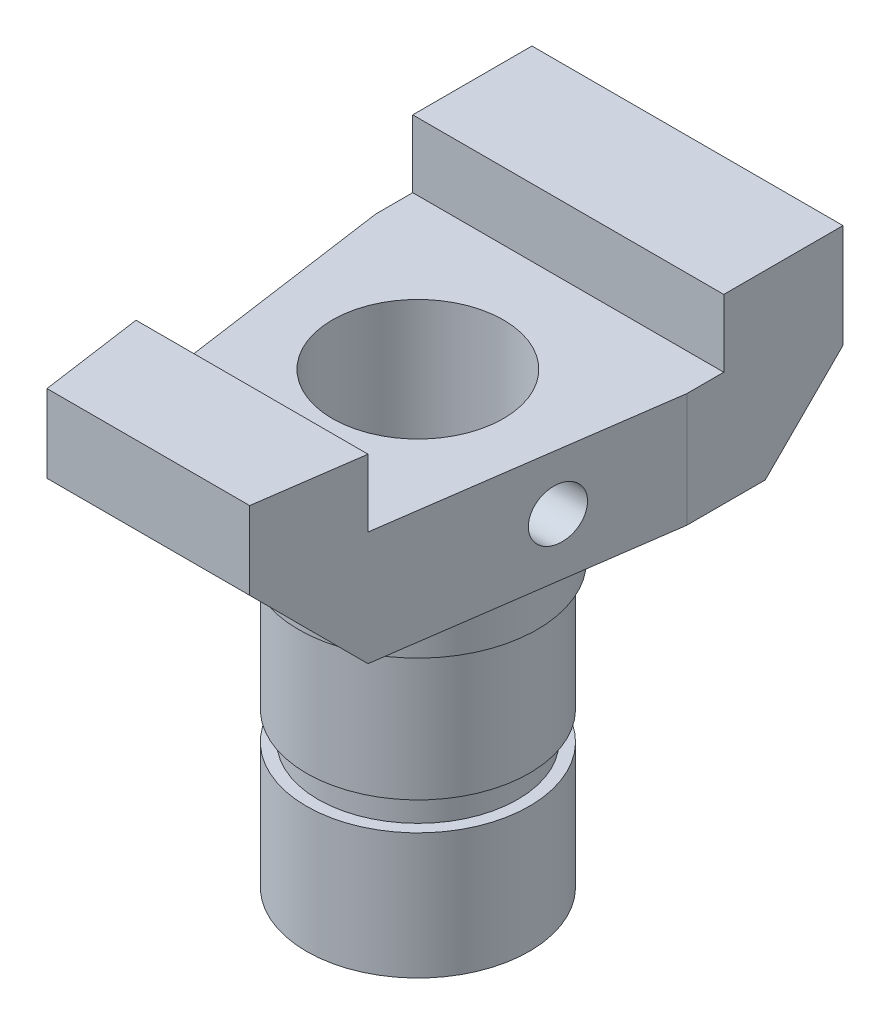
ISO-10303-21;
HEADER;
FILE_DESCRIPTION(('STEP AP214'),'2;1');
FILE_NAME('part.step','',(''),(''),'','','');
FILE_SCHEMA(('AUTOMOTIVE_DESIGN { 1 0 10303 214 1 1 1 1 }'));
ENDSEC;
DATA;
#1=APPLICATION_CONTEXT('core data for automotive mechanical design processes');
#2=APPLICATION_PROTOCOL_DEFINITION('international standard','automotive_design',2000,#1);
#3=PRODUCT_CONTEXT('',#1,'mechanical');
#4=PRODUCT('Part','Part','',(#3));
#5=PRODUCT_RELATED_PRODUCT_CATEGORY('part','',(#4));
#6=PRODUCT_DEFINITION_FORMATION('','',#4);
#7=PRODUCT_DEFINITION_CONTEXT('part definition',#1,'design');
#8=PRODUCT_DEFINITION('design','',#6,#7);
#9=PRODUCT_DEFINITION_SHAPE('','',#8);
#10=(LENGTH_UNIT() NAMED_UNIT(*) SI_UNIT(.MILLI.,.METRE.));
#11=(NAMED_UNIT(*) PLANE_ANGLE_UNIT() SI_UNIT($,.RADIAN.));
#12=(NAMED_UNIT(*) SI_UNIT($,.STERADIAN.) SOLID_ANGLE_UNIT());
#13=UNCERTAINTY_MEASURE_WITH_UNIT(LENGTH_MEASURE(1.E-05),#10,'distance_accuracy_value','');
#14=(GEOMETRIC_REPRESENTATION_CONTEXT(3) GLOBAL_UNCERTAINTY_ASSIGNED_CONTEXT((#13)) GLOBAL_UNIT_ASSIGNED_CONTEXT((#10,
#11,#12)) REPRESENTATION_CONTEXT('',''));
#15=CARTESIAN_POINT('',(0.,0.,0.));
#16=DIRECTION('',(0.,0.,1.));
#17=DIRECTION('',(1.,0.,0.));
#18=AXIS2_PLACEMENT_3D('',#15,#16,#17);
#19=CARTESIAN_POINT('',(30.,-3.,52.));
#20=DIRECTION('',(0.,1.,0.));
#21=DIRECTION('',(0.,0.,1.));
#22=AXIS2_PLACEMENT_3D('',#19,#20,#21);
#23=CONICAL_SURFACE('',#22,23.,0.785398163397449);
#24=CARTESIAN_POINT('',(30.,0.,52.));
#25=DIRECTION('',(0.,-1.,0.));
#26=DIRECTION('',(0.,0.,-1.));
#27=AXIS2_PLACEMENT_3D('',#24,#25,#26);
#28=CIRCLE('',#27,26.);
#29=CARTESIAN_POINT('',(30.,0.,26.));
#30=VERTEX_POINT('',#29);
#31=EDGE_CURVE('E62',#30,#30,#28,.T.);
#32=ORIENTED_EDGE('',*,*,#31,.T.);
#33=EDGE_LOOP('',(#32));
#34=FACE_BOUND('',#33,.T.);
#35=CARTESIAN_POINT('',(30.,-3.,52.));
#36=DIRECTION('',(0.,-1.,0.));
#37=DIRECTION('',(0.,0.,-1.));
#38=AXIS2_PLACEMENT_3D('',#35,#36,#37);
#39=CIRCLE('',#38,23.);
#40=CARTESIAN_POINT('',(30.,-3.,29.));
#41=VERTEX_POINT('',#40);
#42=EDGE_CURVE('E12',#41,#41,#39,.T.);
#43=ORIENTED_EDGE('',*,*,#42,.F.);
#44=EDGE_LOOP('',(#43));
#45=FACE_BOUND('',#44,.T.);
#46=ADVANCED_FACE('F52',(#34,#45),#23,.T.);
#47=CARTESIAN_POINT('',(30.,-10.,52.));
#48=DIRECTION('',(0.,-1.,0.));
#49=DIRECTION('',(0.,0.,-1.));
#50=AXIS2_PLACEMENT_3D('',#47,#48,#49);
#51=CYLINDRICAL_SURFACE('',#50,23.);
#52=ORIENTED_EDGE('',*,*,#42,.T.);
#53=EDGE_LOOP('',(#52));
#54=FACE_BOUND('',#53,.T.);
#55=CARTESIAN_POINT('',(30.,0.,52.));
#56=DIRECTION('',(0.,-1.,0.));
#57=DIRECTION('',(0.,0.,-1.));
#58=AXIS2_PLACEMENT_3D('',#55,#56,#57);
#59=CIRCLE('',#58,23.);
#60=CARTESIAN_POINT('',(30.,0.,29.));
#61=VERTEX_POINT('',#60);
#62=EDGE_CURVE('E58',#61,#61,#59,.T.);
#63=ORIENTED_EDGE('',*,*,#62,.F.);
#64=EDGE_LOOP('',(#63));
#65=FACE_BOUND('',#64,.T.);
#66=ADVANCED_FACE('F73',(#54,#65),#51,.F.);
#67=CARTESIAN_POINT('',(53.,0.,52.));
#68=DIRECTION('',(0.,1.,0.));
#69=DIRECTION('',(0.,0.,1.));
#70=AXIS2_PLACEMENT_3D('',#67,#68,#69);
#71=PLANE('',#70);
#72=ORIENTED_EDGE('',*,*,#62,.T.);
#73=EDGE_LOOP('',(#72));
#74=FACE_BOUND('',#73,.T.);
#75=ORIENTED_EDGE('',*,*,#31,.F.);
#76=EDGE_LOOP('',(#75));
#77=FACE_BOUND('',#76,.T.);
#78=ADVANCED_FACE('F71',(#74,#77),#71,.T.);
#79=CLOSED_SHELL('',(#46,#66,#78));
#80=MANIFOLD_SOLID_BREP('B2',#79);
#81=CARTESIAN_POINT('',(30.,-34.7526530404697,52.));
#82=DIRECTION('',(0.,1.,0.));
#83=DIRECTION('',(0.,0.,1.));
#84=AXIS2_PLACEMENT_3D('',#81,#82,#83);
#85=PLANE('',#84);
#86=CARTESIAN_POINT('',(30.,-34.7526530404697,52.));
#87=DIRECTION('',(0.,1.,0.));
#88=DIRECTION('',(0.,0.,1.));
#89=AXIS2_PLACEMENT_3D('',#86,#87,#88);
#90=CIRCLE('',#89,21.5);
#91=CARTESIAN_POINT('',(30.,-34.7526530404697,73.5));
#92=VERTEX_POINT('',#91);
#93=EDGE_CURVE('E341',#92,#92,#90,.T.);
#94=ORIENTED_EDGE('',*,*,#93,.F.);
#95=EDGE_LOOP('',(#94));
#96=FACE_BOUND('',#95,.T.);
#97=CARTESIAN_POINT('',(30.,-34.7526530404697,52.));
#98=DIRECTION('',(0.,1.,0.));
#99=DIRECTION('',(0.,0.,1.));
#100=AXIS2_PLACEMENT_3D('',#97,#98,#99);
#101=CIRCLE('',#100,19.248069568678);
#102=CARTESIAN_POINT('',(30.,-34.7526530404697,71.248069568678));
#103=VERTEX_POINT('',#102);
#104=EDGE_CURVE('E344',#103,#103,#101,.F.);
#105=ORIENTED_EDGE('',*,*,#104,.F.);
#106=EDGE_LOOP('',(#105));
#107=FACE_BOUND('',#106,.T.);
#108=ADVANCED_FACE('F99',(#96,#107),#85,.F.);
#109=CARTESIAN_POINT('',(30.,-32.2616098393399,52.));
#110=DIRECTION('',(0.,-1.,0.));
#111=DIRECTION('',(0.,0.,-1.));
#112=AXIS2_PLACEMENT_3D('',#109,#110,#111);
#113=CYLINDRICAL_SURFACE('',#112,19.248069568678);
#114=ORIENTED_EDGE('',*,*,#104,.T.);
#115=EDGE_LOOP('',(#114));
#116=FACE_BOUND('',#115,.T.);
#117=CARTESIAN_POINT('',(30.,-40.2528379739233,52.));
#118=DIRECTION('',(0.,1.,0.));
#119=DIRECTION('',(0.,0.,1.));
#120=AXIS2_PLACEMENT_3D('',#117,#118,#119);
#121=CIRCLE('',#120,19.248069568678);
#122=CARTESIAN_POINT('',(30.,-40.2528379739233,71.248069568678));
#123=VERTEX_POINT('',#122);
#124=EDGE_CURVE('E103',#123,#123,#121,.F.);
#125=ORIENTED_EDGE('',*,*,#124,.F.);
#126=EDGE_LOOP('',(#125));
#127=FACE_BOUND('',#126,.T.);
#128=ADVANCED_FACE('F320',(#116,#127),#113,.T.);
#129=CARTESIAN_POINT('',(30.,-66.,52.));
#130=DIRECTION('',(0.,1.,0.));
#131=DIRECTION('',(0.,0.,1.));
#132=AXIS2_PLACEMENT_3D('',#129,#130,#131);
#133=CYLINDRICAL_SURFACE('',#132,21.5);
#134=CARTESIAN_POINT('',(30.,-10.,52.));
#135=DIRECTION('',(0.,1.,0.));
#136=DIRECTION('',(0.,0.,1.));
#137=AXIS2_PLACEMENT_3D('',#134,#135,#136);
#138=CIRCLE('',#137,21.5);
#139=CARTESIAN_POINT('',(30.,-10.,73.5));
#140=VERTEX_POINT('',#139);
#141=EDGE_CURVE('E354',#140,#140,#138,.F.);
#142=ORIENTED_EDGE('',*,*,#141,.T.);
#143=EDGE_LOOP('',(#142));
#144=FACE_BOUND('',#143,.T.);
#145=ORIENTED_EDGE('',*,*,#93,.T.);
#146=EDGE_LOOP('',(#145));
#147=FACE_BOUND('',#146,.T.);
#148=ADVANCED_FACE('F317',(#144,#147),#133,.T.);
#149=CARTESIAN_POINT('',(30.,-40.2528379739233,52.));
#150=DIRECTION('',(0.,1.,0.));
#151=DIRECTION('',(0.,0.,1.));
#152=AXIS2_PLACEMENT_3D('',#149,#150,#151);
#153=PLANE('',#152);
#154=CARTESIAN_POINT('',(30.,-40.2528379739233,52.));
#155=DIRECTION('',(0.,1.,0.));
#156=DIRECTION('',(0.,0.,1.));
#157=AXIS2_PLACEMENT_3D('',#154,#155,#156);
#158=CIRCLE('',#157,21.5);
#159=CARTESIAN_POINT('',(30.,-40.2528379739233,73.5));
#160=VERTEX_POINT('',#159);
#161=EDGE_CURVE('E351',#160,#160,#158,.F.);
#162=ORIENTED_EDGE('',*,*,#161,.F.);
#163=EDGE_LOOP('',(#162));
#164=FACE_BOUND('',#163,.T.);
#165=ORIENTED_EDGE('',*,*,#124,.T.);
#166=EDGE_LOOP('',(#165));
#167=FACE_BOUND('',#166,.T.);
#168=ADVANCED_FACE('F101',(#164,#167),#153,.T.);
#169=CARTESIAN_POINT('',(30.,-10.,52.));
#170=DIRECTION('',(0.,1.,0.));
#171=DIRECTION('',(0.,0.,1.));
#172=AXIS2_PLACEMENT_3D('',#169,#170,#171);
#173=PLANE('',#172);
#174=CARTESIAN_POINT('',(30.,-10.,52.));
#175=DIRECTION('',(0.,1.,0.));
#176=DIRECTION('',(0.,0.,1.));
#177=AXIS2_PLACEMENT_3D('',#174,#175,#176);
#178=CIRCLE('',#177,23.);
#179=CARTESIAN_POINT('',(30.,-10.,75.));
#180=VERTEX_POINT('',#179);
#181=EDGE_CURVE('E353',#180,#180,#178,.T.);
#182=ORIENTED_EDGE('',*,*,#181,.F.);
#183=EDGE_LOOP('',(#182));
#184=FACE_BOUND('',#183,.T.);
#185=ORIENTED_EDGE('',*,*,#141,.F.);
#186=EDGE_LOOP('',(#185));
#187=FACE_BOUND('',#186,.T.);
#188=ADVANCED_FACE('F312',(#184,#187),#173,.F.);
#189=CARTESIAN_POINT('',(30.,-37.9834483062288,52.));
#190=DIRECTION('',(0.,-1.,0.));
#191=DIRECTION('',(0.,0.,-1.));
#192=AXIS2_PLACEMENT_3D('',#189,#190,#191);
#193=CYLINDRICAL_SURFACE('',#192,21.5);
#194=CARTESIAN_POINT('',(30.,-64.5045488826458,52.));
#195=DIRECTION('',(0.,1.,0.));
#196=DIRECTION('',(0.,0.,1.));
#197=AXIS2_PLACEMENT_3D('',#194,#195,#196);
#198=CIRCLE('',#197,21.5);
#199=CARTESIAN_POINT('',(30.,-64.5045488826458,73.5));
#200=VERTEX_POINT('',#199);
#201=EDGE_CURVE('E413',#200,#200,#198,.T.);
#202=ORIENTED_EDGE('',*,*,#201,.T.);
#203=EDGE_LOOP('',(#202));
#204=FACE_BOUND('',#203,.T.);
#205=ORIENTED_EDGE('',*,*,#161,.T.);
#206=EDGE_LOOP('',(#205));
#207=FACE_BOUND('',#206,.T.);
#208=ADVANCED_FACE('F308',(#204,#207),#193,.T.);
#209=CARTESIAN_POINT('',(30.,-10.,52.));
#210=DIRECTION('',(0.,1.,0.));
#211=DIRECTION('',(0.,0.,1.));
#212=AXIS2_PLACEMENT_3D('',#209,#210,#211);
#213=CYLINDRICAL_SURFACE('',#212,23.);
#214=CARTESIAN_POINT('',(30.,0.,52.));
#215=DIRECTION('',(0.,1.,0.));
#216=DIRECTION('',(0.,0.,1.));
#217=AXIS2_PLACEMENT_3D('',#214,#215,#216);
#218=CIRCLE('',#217,23.);
#219=CARTESIAN_POINT('',(30.,0.,75.));
#220=VERTEX_POINT('',#219);
#221=EDGE_CURVE('E442',#220,#220,#218,.T.);
#222=ORIENTED_EDGE('',*,*,#221,.F.);
#223=EDGE_LOOP('',(#222));
#224=FACE_BOUND('',#223,.T.);
#225=ORIENTED_EDGE('',*,*,#181,.T.);
#226=EDGE_LOOP('',(#225));
#227=FACE_BOUND('',#226,.T.);
#228=ADVANCED_FACE('F304',(#224,#227),#213,.T.);
#229=CARTESIAN_POINT('',(0.,0.,15.));
#230=DIRECTION('',(0.,0.707106781186548,0.707106781186548));
#231=DIRECTION('',(0.,-0.707106781186548,0.707106781186548));
#232=AXIS2_PLACEMENT_3D('',#229,#230,#231);
#233=PLANE('',#232);
#234=DIRECTION('',(-1.,0.,0.));
#235=VECTOR('',#234,1.);
#236=CARTESIAN_POINT('',(30.,15.,0.));
#237=LINE('',#236,#235);
#238=CARTESIAN_POINT('',(60.,15.,0.));
#239=VERTEX_POINT('',#238);
#240=CARTESIAN_POINT('',(0.,15.,0.));
#241=VERTEX_POINT('',#240);
#242=EDGE_CURVE('E358',#239,#241,#237,.T.);
#243=ORIENTED_EDGE('',*,*,#242,.F.);
#244=DIRECTION('',(0.,0.707106781186547,-0.707106781186547));
#245=VECTOR('',#244,1.);
#246=CARTESIAN_POINT('',(60.,0.,15.));
#247=LINE('',#246,#245);
#248=CARTESIAN_POINT('',(60.,0.,15.));
#249=VERTEX_POINT('',#248);
#250=EDGE_CURVE('E421',#249,#239,#247,.T.);
#251=ORIENTED_EDGE('',*,*,#250,.F.);
#252=DIRECTION('',(1.,0.,0.));
#253=VECTOR('',#252,1.);
#254=CARTESIAN_POINT('',(0.,0.,15.));
#255=LINE('',#254,#253);
#256=CARTESIAN_POINT('',(0.,0.,15.));
#257=VERTEX_POINT('',#256);
#258=EDGE_CURVE('E437',#257,#249,#255,.T.);
#259=ORIENTED_EDGE('',*,*,#258,.F.);
#260=DIRECTION('',(0.,-0.707106781186547,0.707106781186547));
#261=VECTOR('',#260,1.);
#262=CARTESIAN_POINT('',(0.,15.,0.));
#263=LINE('',#262,#261);
#264=EDGE_CURVE('E443',#241,#257,#263,.T.);
#265=ORIENTED_EDGE('',*,*,#264,.F.);
#266=EDGE_LOOP('',(#243,#251,#259,#265));
#267=FACE_BOUND('',#266,.T.);
#268=ADVANCED_FACE('F300',(#267),#233,.F.);
#269=CARTESIAN_POINT('',(30.,35.,0.));
#270=DIRECTION('',(0.,0.,-1.));
#271=DIRECTION('',(-1.,0.,0.));
#272=AXIS2_PLACEMENT_3D('',#269,#270,#271);
#273=PLANE('',#272);
#274=DIRECTION('',(0.,1.,0.));
#275=VECTOR('',#274,1.);
#276=CARTESIAN_POINT('',(60.,35.,0.));
#277=LINE('',#276,#275);
#278=CARTESIAN_POINT('',(60.,35.,0.));
#279=VERTEX_POINT('',#278);
#280=EDGE_CURVE('E418',#239,#279,#277,.T.);
#281=ORIENTED_EDGE('',*,*,#280,.F.);
#282=ORIENTED_EDGE('',*,*,#242,.T.);
#283=DIRECTION('',(0.,1.,0.));
#284=VECTOR('',#283,1.);
#285=CARTESIAN_POINT('',(0.,35.,0.));
#286=LINE('',#285,#284);
#287=CARTESIAN_POINT('',(0.,35.,0.));
#288=VERTEX_POINT('',#287);
#289=EDGE_CURVE('E445',#288,#241,#286,.F.);
#290=ORIENTED_EDGE('',*,*,#289,.F.);
#291=DIRECTION('',(1.,0.,0.));
#292=VECTOR('',#291,1.);
#293=CARTESIAN_POINT('',(0.,35.,0.));
#294=LINE('',#293,#292);
#295=EDGE_CURVE('E369',#288,#279,#294,.T.);
#296=ORIENTED_EDGE('',*,*,#295,.T.);
#297=EDGE_LOOP('',(#281,#282,#290,#296));
#298=FACE_BOUND('',#297,.T.);
#299=ADVANCED_FACE('F296',(#298),#273,.T.);
#300=CARTESIAN_POINT('',(0.,0.,84.));
#301=DIRECTION('',(0.,0.707106781186548,-0.707106781186547));
#302=DIRECTION('',(0.,0.707106781186547,0.707106781186548));
#303=AXIS2_PLACEMENT_3D('',#300,#301,#302);
#304=PLANE('',#303);
#305=DIRECTION('',(1.,0.,0.));
#306=VECTOR('',#305,1.);
#307=CARTESIAN_POINT('',(8.63207958549231,20.,104.));
#308=LINE('',#307,#306);
#309=CARTESIAN_POINT('',(10.4523067731235,20.,104.));
#310=VERTEX_POINT('',#309);
#311=CARTESIAN_POINT('',(49.5476932268765,20.,104.));
#312=VERTEX_POINT('',#311);
#313=EDGE_CURVE('E416',#310,#312,#308,.T.);
#314=ORIENTED_EDGE('',*,*,#313,.F.);
#315=DIRECTION('',(0.0995651231268555,0.703593201451213,0.703593201451213));
#316=VECTOR('',#315,1.);
#317=CARTESIAN_POINT('',(7.54655707262303,-0.533954764322473,83.4660452356775));
#318=LINE('',#317,#316);
#319=CARTESIAN_POINT('',(7.62211674509327,0.,84.));
#320=VERTEX_POINT('',#319);
#321=EDGE_CURVE('E391',#320,#310,#318,.T.);
#322=ORIENTED_EDGE('',*,*,#321,.F.);
#323=DIRECTION('',(1.,0.,0.));
#324=VECTOR('',#323,1.);
#325=CARTESIAN_POINT('',(0.,0.,84.));
#326=LINE('',#325,#324);
#327=CARTESIAN_POINT('',(52.3778832549067,0.,84.));
#328=VERTEX_POINT('',#327);
#329=EDGE_CURVE('E434',#328,#320,#326,.F.);
#330=ORIENTED_EDGE('',*,*,#329,.F.);
#331=DIRECTION('',(0.0995651231268555,-0.703593201451213,-0.703593201451213));
#332=VECTOR('',#331,1.);
#333=CARTESIAN_POINT('',(51.858650102781,3.66924585970003,87.6692458597));
#334=LINE('',#333,#332);
#335=EDGE_CURVE('E397',#312,#328,#334,.T.);
#336=ORIENTED_EDGE('',*,*,#335,.F.);
#337=EDGE_LOOP('',(#314,#322,#330,#336));
#338=FACE_BOUND('',#337,.T.);
#339=ADVANCED_FACE('F292',(#338),#304,.F.);
#340=CARTESIAN_POINT('',(8.63207958549231,35.,104.));
#341=DIRECTION('',(0.,0.,1.));
#342=DIRECTION('',(1.,0.,0.));
#343=AXIS2_PLACEMENT_3D('',#340,#341,#342);
#344=PLANE('',#343);
#345=DIRECTION('',(0.,-1.,0.));
#346=VECTOR('',#345,1.);
#347=CARTESIAN_POINT('',(10.4523067731235,35.,104.));
#348=LINE('',#347,#346);
#349=CARTESIAN_POINT('',(10.4523067731235,35.,104.));
#350=VERTEX_POINT('',#349);
#351=EDGE_CURVE('E348',#350,#310,#348,.T.);
#352=ORIENTED_EDGE('',*,*,#351,.T.);
#353=ORIENTED_EDGE('',*,*,#313,.T.);
#354=DIRECTION('',(0.,1.,0.));
#355=VECTOR('',#354,1.);
#356=CARTESIAN_POINT('',(49.5476932268765,35.,104.));
#357=LINE('',#356,#355);
#358=CARTESIAN_POINT('',(49.5476932268765,35.,104.));
#359=VERTEX_POINT('',#358);
#360=EDGE_CURVE('E405',#312,#359,#357,.T.);
#361=ORIENTED_EDGE('',*,*,#360,.T.);
#362=DIRECTION('',(1.,0.,0.));
#363=VECTOR('',#362,1.);
#364=CARTESIAN_POINT('',(8.63207958549231,35.,104.));
#365=LINE('',#364,#363);
#366=EDGE_CURVE('E366',#350,#359,#365,.T.);
#367=ORIENTED_EDGE('',*,*,#366,.F.);
#368=EDGE_LOOP('',(#352,#353,#361,#367));
#369=FACE_BOUND('',#368,.T.);
#370=ADVANCED_FACE('F289',(#369),#344,.T.);
#371=CARTESIAN_POINT('',(30.,-64.5045488826458,52.));
#372=DIRECTION('',(0.,1.,0.));
#373=DIRECTION('',(0.,0.,1.));
#374=AXIS2_PLACEMENT_3D('',#371,#372,#373);
#375=PLANE('',#374);
#376=CARTESIAN_POINT('',(30.,-64.5045488826458,37.));
#377=DIRECTION('',(0.,-1.,0.));
#378=DIRECTION('',(0.,0.,-1.));
#379=AXIS2_PLACEMENT_3D('',#376,#377,#378);
#380=CIRCLE('',#379,2.09999999999999);
#381=CARTESIAN_POINT('',(30.,-64.5045488826458,34.9));
#382=VERTEX_POINT('',#381);
#383=EDGE_CURVE('E201',#382,#382,#380,.T.);
#384=ORIENTED_EDGE('',*,*,#383,.F.);
#385=EDGE_LOOP('',(#384));
#386=FACE_BOUND('',#385,.T.);
#387=CARTESIAN_POINT('',(30.,-64.5045488826458,67.));
#388=DIRECTION('',(0.,-1.,0.));
#389=DIRECTION('',(0.,0.,-1.));
#390=AXIS2_PLACEMENT_3D('',#387,#388,#389);
#391=CIRCLE('',#390,2.09999999999999);
#392=CARTESIAN_POINT('',(30.,-64.5045488826458,64.9));
#393=VERTEX_POINT('',#392);
#394=EDGE_CURVE('E200',#393,#393,#391,.T.);
#395=ORIENTED_EDGE('',*,*,#394,.F.);
#396=EDGE_LOOP('',(#395));
#397=FACE_BOUND('',#396,.T.);
#398=ORIENTED_EDGE('',*,*,#201,.F.);
#399=EDGE_LOOP('',(#398));
#400=FACE_BOUND('',#399,.T.);
#401=CARTESIAN_POINT('',(30.,-64.5045488826458,52.));
#402=DIRECTION('',(0.,1.,0.));
#403=DIRECTION('',(0.,0.,1.));
#404=AXIS2_PLACEMENT_3D('',#401,#402,#403);
#405=CIRCLE('',#404,11.5);
#406=CARTESIAN_POINT('',(30.,-64.5045488826458,63.5));
#407=VERTEX_POINT('',#406);
#408=EDGE_CURVE('E379',#407,#407,#405,.T.);
#409=ORIENTED_EDGE('',*,*,#408,.T.);
#410=EDGE_LOOP('',(#409));
#411=FACE_BOUND('',#410,.T.);
#412=ADVANCED_FACE('F287',(#386,#397,#400,#411),#375,.F.);
#413=CARTESIAN_POINT('',(0.,35.,0.));
#414=DIRECTION('',(0.,-1.,0.));
#415=DIRECTION('',(0.,0.,-1.));
#416=AXIS2_PLACEMENT_3D('',#413,#414,#415);
#417=PLANE('',#416);
#418=DIRECTION('',(0.,0.,1.));
#419=VECTOR('',#418,1.);
#420=CARTESIAN_POINT('',(0.,35.,0.));
#421=LINE('',#420,#419);
#422=CARTESIAN_POINT('',(0.,35.,23.));
#423=VERTEX_POINT('',#422);
#424=EDGE_CURVE('E415',#423,#288,#421,.F.);
#425=ORIENTED_EDGE('',*,*,#424,.F.);
#426=DIRECTION('',(1.,0.,0.));
#427=VECTOR('',#426,1.);
#428=CARTESIAN_POINT('',(60.,35.,23.));
#429=LINE('',#428,#427);
#430=CARTESIAN_POINT('',(60.,35.,23.));
#431=VERTEX_POINT('',#430);
#432=EDGE_CURVE('E376',#431,#423,#429,.F.);
#433=ORIENTED_EDGE('',*,*,#432,.F.);
#434=DIRECTION('',(0.,0.,-1.));
#435=VECTOR('',#434,1.);
#436=CARTESIAN_POINT('',(60.,35.,0.));
#437=LINE('',#436,#435);
#438=EDGE_CURVE('E432',#279,#431,#437,.F.);
#439=ORIENTED_EDGE('',*,*,#438,.F.);
#440=ORIENTED_EDGE('',*,*,#295,.F.);
#441=EDGE_LOOP('',(#425,#433,#439,#440));
#442=FACE_BOUND('',#441,.T.);
#443=ADVANCED_FACE('F283',(#442),#417,.F.);
#444=CARTESIAN_POINT('',(0.,35.,0.));
#445=DIRECTION('',(-1.,0.,0.));
#446=DIRECTION('',(0.,0.,1.));
#447=AXIS2_PLACEMENT_3D('',#444,#445,#446);
#448=PLANE('',#447);
#449=ORIENTED_EDGE('',*,*,#424,.T.);
#450=ORIENTED_EDGE('',*,*,#289,.T.);
#451=ORIENTED_EDGE('',*,*,#264,.T.);
#452=DIRECTION('',(0.,0.,-1.));
#453=VECTOR('',#452,1.);
#454=CARTESIAN_POINT('',(0.,0.,0.));
#455=LINE('',#454,#453);
#456=CARTESIAN_POINT('',(0.,0.,30.1370673375027));
#457=VERTEX_POINT('',#456);
#458=EDGE_CURVE('E439',#457,#257,#455,.T.);
#459=ORIENTED_EDGE('',*,*,#458,.F.);
#460=DIRECTION('',(0.,-1.,0.));
#461=VECTOR('',#460,1.);
#462=CARTESIAN_POINT('',(0.,35.,30.1370673375027));
#463=LINE('',#462,#461);
#464=CARTESIAN_POINT('',(0.,22.,30.1370673375027));
#465=VERTEX_POINT('',#464);
#466=EDGE_CURVE('E377',#465,#457,#463,.T.);
#467=ORIENTED_EDGE('',*,*,#466,.F.);
#468=DIRECTION('',(0.,0.,1.));
#469=VECTOR('',#468,1.);
#470=CARTESIAN_POINT('',(0.,22.,0.));
#471=LINE('',#470,#469);
#472=CARTESIAN_POINT('',(0.,22.,23.));
#473=VERTEX_POINT('',#472);
#474=EDGE_CURVE('E109',#473,#465,#471,.T.);
#475=ORIENTED_EDGE('',*,*,#474,.F.);
#476=DIRECTION('',(0.,1.,0.));
#477=VECTOR('',#476,1.);
#478=CARTESIAN_POINT('',(0.,23.,23.));
#479=LINE('',#478,#477);
#480=EDGE_CURVE('E486',#423,#473,#479,.F.);
#481=ORIENTED_EDGE('',*,*,#480,.F.);
#482=EDGE_LOOP('',(#449,#450,#451,#459,#467,#475,#481));
#483=FACE_BOUND('',#482,.T.);
#484=ADVANCED_FACE('F279',(#483),#448,.T.);
#485=CARTESIAN_POINT('',(0.,0.,0.));
#486=DIRECTION('',(0.,-1.,0.));
#487=DIRECTION('',(0.,0.,-1.));
#488=AXIS2_PLACEMENT_3D('',#485,#486,#487);
#489=PLANE('',#488);
#490=ORIENTED_EDGE('',*,*,#329,.T.);
#491=DIRECTION('',(0.140113572243511,0.,0.99013543865128));
#492=VECTOR('',#491,1.);
#493=CARTESIAN_POINT('',(7.64194414684103,0.,84.1401135722435));
#494=LINE('',#493,#492);
#495=EDGE_CURVE('E373',#457,#320,#494,.T.);
#496=ORIENTED_EDGE('',*,*,#495,.F.);
#497=ORIENTED_EDGE('',*,*,#458,.T.);
#498=ORIENTED_EDGE('',*,*,#258,.T.);
#499=DIRECTION('',(0.,0.,-1.));
#500=VECTOR('',#499,1.);
#501=CARTESIAN_POINT('',(60.,0.,0.));
#502=LINE('',#501,#500);
#503=CARTESIAN_POINT('',(60.,0.,30.1370673375028));
#504=VERTEX_POINT('',#503);
#505=EDGE_CURVE('E425',#504,#249,#502,.T.);
#506=ORIENTED_EDGE('',*,*,#505,.F.);
#507=DIRECTION('',(0.140113572243511,0.,-0.99013543865128));
#508=VECTOR('',#507,1.);
#509=CARTESIAN_POINT('',(52.358055853159,0.,84.1401135722435));
#510=LINE('',#509,#508);
#511=EDGE_CURVE('E399',#328,#504,#510,.T.);
#512=ORIENTED_EDGE('',*,*,#511,.F.);
#513=EDGE_LOOP('',(#490,#496,#497,#498,#506,#512));
#514=FACE_BOUND('',#513,.T.);
#515=ORIENTED_EDGE('',*,*,#221,.T.);
#516=EDGE_LOOP('',(#515));
#517=FACE_BOUND('',#516,.T.);
#518=ADVANCED_FACE('F275',(#514,#517),#489,.T.);
#519=CARTESIAN_POINT('',(60.,35.,0.));
#520=DIRECTION('',(1.,0.,0.));
#521=DIRECTION('',(0.,0.,-1.));
#522=AXIS2_PLACEMENT_3D('',#519,#520,#521);
#523=PLANE('',#522);
#524=ORIENTED_EDGE('',*,*,#280,.T.);
#525=ORIENTED_EDGE('',*,*,#438,.T.);
#526=DIRECTION('',(0.,1.,0.));
#527=VECTOR('',#526,1.);
#528=CARTESIAN_POINT('',(60.,23.,23.));
#529=LINE('',#528,#527);
#530=CARTESIAN_POINT('',(60.,22.,23.));
#531=VERTEX_POINT('',#530);
#532=EDGE_CURVE('E403',#531,#431,#529,.T.);
#533=ORIENTED_EDGE('',*,*,#532,.F.);
#534=DIRECTION('',(0.,0.,1.));
#535=VECTOR('',#534,1.);
#536=CARTESIAN_POINT('',(60.,22.,0.));
#537=LINE('',#536,#535);
#538=CARTESIAN_POINT('',(60.,22.,30.1370673375028));
#539=VERTEX_POINT('',#538);
#540=EDGE_CURVE('E50',#531,#539,#537,.T.);
#541=ORIENTED_EDGE('',*,*,#540,.T.);
#542=DIRECTION('',(0.,1.,0.));
#543=VECTOR('',#542,1.);
#544=CARTESIAN_POINT('',(60.,35.,30.1370673375028));
#545=LINE('',#544,#543);
#546=EDGE_CURVE('E402',#504,#539,#545,.T.);
#547=ORIENTED_EDGE('',*,*,#546,.F.);
#548=ORIENTED_EDGE('',*,*,#505,.T.);
#549=ORIENTED_EDGE('',*,*,#250,.T.);
#550=EDGE_LOOP('',(#524,#525,#533,#541,#547,#548,#549));
#551=FACE_BOUND('',#550,.T.);
#552=ADVANCED_FACE('F271',(#551),#523,.T.);
#553=CARTESIAN_POINT('',(0.,35.,0.));
#554=DIRECTION('',(0.,-1.,0.));
#555=DIRECTION('',(0.,0.,-1.));
#556=AXIS2_PLACEMENT_3D('',#553,#554,#555);
#557=PLANE('',#556);
#558=DIRECTION('',(-1.,0.,0.));
#559=VECTOR('',#558,1.);
#560=CARTESIAN_POINT('',(51.3679204145077,35.,84.));
#561=LINE('',#560,#559);
#562=CARTESIAN_POINT('',(7.62211674509326,35.,84.));
#563=VERTEX_POINT('',#562);
#564=CARTESIAN_POINT('',(52.3778832549067,35.,84.));
#565=VERTEX_POINT('',#564);
#566=EDGE_CURVE('E410',#563,#565,#561,.F.);
#567=ORIENTED_EDGE('',*,*,#566,.F.);
#568=DIRECTION('',(-0.140113572243511,0.,-0.99013543865128));
#569=VECTOR('',#568,1.);
#570=CARTESIAN_POINT('',(-4.18095794488078,35.,0.591645274160773));
#571=LINE('',#570,#569);
#572=EDGE_CURVE('E345',#350,#563,#571,.T.);
#573=ORIENTED_EDGE('',*,*,#572,.F.);
#574=ORIENTED_EDGE('',*,*,#366,.T.);
#575=DIRECTION('',(-0.140113572243511,0.,0.99013543865128));
#576=VECTOR('',#575,1.);
#577=CARTESIAN_POINT('',(63.0030491572705,35.,8.91553007302037));
#578=LINE('',#577,#576);
#579=EDGE_CURVE('E393',#565,#359,#578,.T.);
#580=ORIENTED_EDGE('',*,*,#579,.F.);
#581=EDGE_LOOP('',(#567,#573,#574,#580));
#582=FACE_BOUND('',#581,.T.);
#583=ADVANCED_FACE('F267',(#582),#557,.F.);
#584=CARTESIAN_POINT('',(30.,-44.2245488826458,52.));
#585=DIRECTION('',(0.,-1.,0.));
#586=DIRECTION('',(0.,0.,-1.));
#587=AXIS2_PLACEMENT_3D('',#584,#585,#586);
#588=CYLINDRICAL_SURFACE('',#587,11.5);
#589=ORIENTED_EDGE('',*,*,#408,.F.);
#590=EDGE_LOOP('',(#589));
#591=FACE_BOUND('',#590,.T.);
#592=CARTESIAN_POINT('',(30.,-44.2245488826458,52.));
#593=DIRECTION('',(0.,-1.,0.));
#594=DIRECTION('',(0.,0.,-1.));
#595=AXIS2_PLACEMENT_3D('',#592,#593,#594);
#596=CIRCLE('',#595,11.5);
#597=CARTESIAN_POINT('',(30.,-44.2245488826458,40.5));
#598=VERTEX_POINT('',#597);
#599=EDGE_CURVE('E384',#598,#598,#596,.T.);
#600=ORIENTED_EDGE('',*,*,#599,.F.);
#601=EDGE_LOOP('',(#600));
#602=FACE_BOUND('',#601,.T.);
#603=ADVANCED_FACE('F264',(#591,#602),#588,.F.);
#604=CARTESIAN_POINT('',(7.64194414684103,35.,84.1401135722435));
#605=DIRECTION('',(-0.99013543865128,0.,0.140113572243511));
#606=DIRECTION('',(0.140113572243511,0.,0.99013543865128));
#607=AXIS2_PLACEMENT_3D('',#604,#605,#606);
#608=PLANE('',#607);
#609=ORIENTED_EDGE('',*,*,#495,.T.);
#610=ORIENTED_EDGE('',*,*,#321,.T.);
#611=ORIENTED_EDGE('',*,*,#351,.F.);
#612=ORIENTED_EDGE('',*,*,#572,.T.);
#613=DIRECTION('',(0.,1.,0.));
#614=VECTOR('',#613,1.);
#615=CARTESIAN_POINT('',(7.62211674509326,23.,84.));
#616=LINE('',#615,#614);
#617=CARTESIAN_POINT('',(7.62211674509327,22.,84.));
#618=VERTEX_POINT('',#617);
#619=EDGE_CURVE('E385',#618,#563,#616,.T.);
#620=ORIENTED_EDGE('',*,*,#619,.F.);
#621=DIRECTION('',(-0.140113572243511,0.,-0.99013543865128));
#622=VECTOR('',#621,1.);
#623=CARTESIAN_POINT('',(-4.18095794488078,22.,0.591645274160773));
#624=LINE('',#623,#622);
#625=EDGE_CURVE('E380',#618,#465,#624,.T.);
#626=ORIENTED_EDGE('',*,*,#625,.T.);
#627=ORIENTED_EDGE('',*,*,#466,.T.);
#628=EDGE_LOOP('',(#609,#610,#611,#612,#620,#626,#627));
#629=FACE_BOUND('',#628,.T.);
#630=ADVANCED_FACE('F262',(#629),#608,.T.);
#631=CARTESIAN_POINT('',(60.,23.,23.));
#632=DIRECTION('',(0.,0.,1.));
#633=DIRECTION('',(1.,0.,0.));
#634=AXIS2_PLACEMENT_3D('',#631,#632,#633);
#635=PLANE('',#634);
#636=DIRECTION('',(1.,0.,0.));
#637=VECTOR('',#636,1.);
#638=CARTESIAN_POINT('',(0.,22.,23.));
#639=LINE('',#638,#637);
#640=EDGE_CURVE('E383',#473,#531,#639,.T.);
#641=ORIENTED_EDGE('',*,*,#640,.T.);
#642=ORIENTED_EDGE('',*,*,#532,.T.);
#643=ORIENTED_EDGE('',*,*,#432,.T.);
#644=ORIENTED_EDGE('',*,*,#480,.T.);
#645=EDGE_LOOP('',(#641,#642,#643,#644));
#646=FACE_BOUND('',#645,.T.);
#647=ADVANCED_FACE('F259',(#646),#635,.T.);
#648=CARTESIAN_POINT('',(52.358055853159,35.,84.1401135722435));
#649=DIRECTION('',(0.99013543865128,0.,0.140113572243511));
#650=DIRECTION('',(0.140113572243511,0.,-0.99013543865128));
#651=AXIS2_PLACEMENT_3D('',#648,#649,#650);
#652=PLANE('',#651);
#653=CARTESIAN_POINT('',(56.9188883274133,11.2415155440414,51.9102461139897));
#654=DIRECTION('',(0.99013543865128,0.,0.140113572243511));
#655=DIRECTION('',(0.140113572243511,0.,-0.99013543865128));
#656=AXIS2_PLACEMENT_3D('',#653,#654,#655);
#657=ELLIPSE('',#656,5.04981420199522,5.);
#658=CARTESIAN_POINT('',(57.6264358344209,11.2415155440414,46.9102461139897));
#659=VERTEX_POINT('',#658);
#660=EDGE_CURVE('E218',#659,#659,#657,.F.);
#661=ORIENTED_EDGE('',*,*,#660,.T.);
#662=EDGE_LOOP('',(#661));
#663=FACE_BOUND('',#662,.T.);
#664=ORIENTED_EDGE('',*,*,#511,.T.);
#665=ORIENTED_EDGE('',*,*,#546,.T.);
#666=DIRECTION('',(-0.140113572243511,0.,0.99013543865128));
#667=VECTOR('',#666,1.);
#668=CARTESIAN_POINT('',(63.0030491572705,22.,8.91553007302037));
#669=LINE('',#668,#667);
#670=CARTESIAN_POINT('',(52.3778832549067,22.,84.));
#671=VERTEX_POINT('',#670);
#672=EDGE_CURVE('E117',#539,#671,#669,.T.);
#673=ORIENTED_EDGE('',*,*,#672,.T.);
#674=DIRECTION('',(0.,-1.,0.));
#675=VECTOR('',#674,1.);
#676=CARTESIAN_POINT('',(52.3778832549067,23.,84.));
#677=LINE('',#676,#675);
#678=EDGE_CURVE('E387',#565,#671,#677,.T.);
#679=ORIENTED_EDGE('',*,*,#678,.F.);
#680=ORIENTED_EDGE('',*,*,#579,.T.);
#681=ORIENTED_EDGE('',*,*,#360,.F.);
#682=ORIENTED_EDGE('',*,*,#335,.T.);
#683=EDGE_LOOP('',(#664,#665,#673,#679,#680,#681,#682));
#684=FACE_BOUND('',#683,.T.);
#685=ADVANCED_FACE('F257',(#663,#684),#652,.T.);
#686=CARTESIAN_POINT('',(51.3679204145077,23.,84.));
#687=DIRECTION('',(0.,0.,-1.));
#688=DIRECTION('',(-1.,0.,0.));
#689=AXIS2_PLACEMENT_3D('',#686,#687,#688);
#690=PLANE('',#689);
#691=DIRECTION('',(1.,0.,0.));
#692=VECTOR('',#691,1.);
#693=CARTESIAN_POINT('',(0.,22.,84.));
#694=LINE('',#693,#692);
#695=EDGE_CURVE('E219',#671,#618,#694,.F.);
#696=ORIENTED_EDGE('',*,*,#695,.T.);
#697=ORIENTED_EDGE('',*,*,#619,.T.);
#698=ORIENTED_EDGE('',*,*,#566,.T.);
#699=ORIENTED_EDGE('',*,*,#678,.T.);
#700=EDGE_LOOP('',(#696,#697,#698,#699));
#701=FACE_BOUND('',#700,.T.);
#702=ADVANCED_FACE('F253',(#701),#690,.T.);
#703=CARTESIAN_POINT('',(30.,-44.2245488826458,52.));
#704=DIRECTION('',(0.,1.,0.));
#705=DIRECTION('',(0.,0.,1.));
#706=AXIS2_PLACEMENT_3D('',#703,#704,#705);
#707=PLANE('',#706);
#708=CARTESIAN_POINT('',(30.,-44.2245488826458,52.));
#709=DIRECTION('',(0.,-1.,0.));
#710=DIRECTION('',(0.,0.,-1.));
#711=AXIS2_PLACEMENT_3D('',#708,#709,#710);
#712=CIRCLE('',#711,16.5);
#713=CARTESIAN_POINT('',(30.,-44.2245488826458,35.5));
#714=VERTEX_POINT('',#713);
#715=EDGE_CURVE('E455',#714,#714,#712,.F.);
#716=ORIENTED_EDGE('',*,*,#715,.T.);
#717=EDGE_LOOP('',(#716));
#718=FACE_BOUND('',#717,.T.);
#719=ORIENTED_EDGE('',*,*,#599,.T.);
#720=EDGE_LOOP('',(#719));
#721=FACE_BOUND('',#720,.T.);
#722=ADVANCED_FACE('F246',(#718,#721),#707,.T.);
#723=CARTESIAN_POINT('',(0.,22.,0.));
#724=DIRECTION('',(0.,-1.,0.));
#725=DIRECTION('',(0.,0.,-1.));
#726=AXIS2_PLACEMENT_3D('',#723,#724,#725);
#727=PLANE('',#726);
#728=ORIENTED_EDGE('',*,*,#672,.F.);
#729=ORIENTED_EDGE('',*,*,#540,.F.);
#730=ORIENTED_EDGE('',*,*,#640,.F.);
#731=ORIENTED_EDGE('',*,*,#474,.T.);
#732=ORIENTED_EDGE('',*,*,#625,.F.);
#733=ORIENTED_EDGE('',*,*,#695,.F.);
#734=EDGE_LOOP('',(#728,#729,#730,#731,#732,#733));
#735=FACE_BOUND('',#734,.T.);
#736=CARTESIAN_POINT('',(30.,22.,52.));
#737=DIRECTION('',(0.,-1.,0.));
#738=DIRECTION('',(0.,0.,-1.));
#739=AXIS2_PLACEMENT_3D('',#736,#737,#738);
#740=CIRCLE('',#739,16.5);
#741=CARTESIAN_POINT('',(30.,22.,35.5));
#742=VERTEX_POINT('',#741);
#743=EDGE_CURVE('E370',#742,#742,#740,.T.);
#744=ORIENTED_EDGE('',*,*,#743,.T.);
#745=EDGE_LOOP('',(#744));
#746=FACE_BOUND('',#745,.T.);
#747=ADVANCED_FACE('F239',(#735,#746),#727,.F.);
#748=CARTESIAN_POINT('',(30.,80.,52.));
#749=DIRECTION('',(0.,-1.,0.));
#750=DIRECTION('',(0.,0.,-1.));
#751=AXIS2_PLACEMENT_3D('',#748,#749,#750);
#752=CYLINDRICAL_SURFACE('',#751,16.5);
#753=CARTESIAN_POINT('',(45.6953625437529,11.2415155440414,46.9102461139897));
#754=CARTESIAN_POINT('',(45.6953651275117,10.96798242066,46.910249144027));
#755=CARTESIAN_POINT('',(45.7027204346676,10.6944193360727,46.9327692068748));
#756=CARTESIAN_POINT('',(45.7312342460886,10.1553099156977,47.0220083920268));
#757=CARTESIAN_POINT('',(45.7523971909797,9.88976618774301,47.088741733716));
#758=CARTESIAN_POINT('',(45.8059384351575,9.37458898885975,47.2639035621255));
#759=CARTESIAN_POINT('',(45.8382972202212,9.12492872376578,47.372259537052));
#760=CARTESIAN_POINT('',(45.91060590809,8.64727342065624,47.6273432416818));
#761=CARTESIAN_POINT('',(45.9505570254146,8.41928185767449,47.7740771119816));
#762=CARTESIAN_POINT('',(46.0351091660479,7.98382417433809,48.1069832949512));
#763=CARTESIAN_POINT('',(46.079814278941,7.77718738609331,48.2942141814724));
#764=CARTESIAN_POINT('',(46.168073992593,7.39769256367235,48.7005233670997));
#765=CARTESIAN_POINT('',(46.2116284310867,7.22483927180582,48.9196061298506));
#766=CARTESIAN_POINT('',(46.293972049571,6.91403438850232,49.3895273354778));
#767=CARTESIAN_POINT('',(46.3326305020367,6.77696485158391,49.640974106507));
#768=CARTESIAN_POINT('',(46.3997358176783,6.54738715470263,50.1647208043434));
#769=CARTESIAN_POINT('',(46.4281848935578,6.45486933744713,50.4370161970354));
#770=CARTESIAN_POINT('',(46.4710754197026,6.31970466487128,50.9864091223573));
#771=CARTESIAN_POINT('',(46.4858974921997,6.27569538500389,51.2631411752828));
#772=CARTESIAN_POINT('',(46.5013753452405,6.23452485386723,51.8204360081517));
#773=CARTESIAN_POINT('',(46.5020342790018,6.2373531746368,52.1009979215136));
#774=CARTESIAN_POINT('',(46.4894664798961,6.28887067757358,52.6479745600465));
#775=CARTESIAN_POINT('',(46.4767061271984,6.33601385968335,52.9145476947423));
#776=CARTESIAN_POINT('',(46.439485215848,6.47232850772575,53.4358453534231));
#777=CARTESIAN_POINT('',(46.4150239907427,6.56150236761665,53.6905692015953));
#778=CARTESIAN_POINT('',(46.3567210543653,6.78019406962234,54.1840578153913));
#779=CARTESIAN_POINT('',(46.3227848867842,6.91011987007774,54.4226301450707));
#780=CARTESIAN_POINT('',(46.2492019052819,7.20630245859458,54.8750746846509));
#781=CARTESIAN_POINT('',(46.2095537477515,7.3725677994373,55.0889410616789));
#782=CARTESIAN_POINT('',(46.1270583296876,7.7442776474283,55.4946434413551));
#783=CARTESIAN_POINT('',(46.0841466464398,7.95098898792383,55.6853071296068));
#784=CARTESIAN_POINT('',(46.001361950671,8.39381277567193,56.0296224286334));
#785=CARTESIAN_POINT('',(45.9614892613509,8.6299283430876,56.183270106453));
#786=CARTESIAN_POINT('',(45.8890408338171,9.12823717115611,56.4506013716464));
#787=CARTESIAN_POINT('',(45.8565482834232,9.39068383573359,56.5638368579256));
#788=CARTESIAN_POINT('',(45.8035379539701,9.93210683681385,56.7441671910017));
#789=CARTESIAN_POINT('',(45.7830163567616,10.211077871544,56.8112767509349));
#790=CARTESIAN_POINT('',(45.7571558088758,10.7667846079902,56.8952953180708));
#791=CARTESIAN_POINT('',(45.7512928678141,11.0432339846565,56.9139378493998));
#792=CARTESIAN_POINT('',(45.7539715578322,11.5953231920103,56.9053448875345));
#793=CARTESIAN_POINT('',(45.7625111739694,11.8709631305354,56.8781158118577));
#794=CARTESIAN_POINT('',(45.7924963527794,12.4061871251698,56.7801193171964));
#795=CARTESIAN_POINT('',(45.8136016998116,12.6660021562504,56.710498558322));
#796=CARTESIAN_POINT('',(45.8659523993163,13.1702471429489,56.5310301114428));
#797=CARTESIAN_POINT('',(45.8971993105401,13.4146747266271,56.4211762393029));
#798=CARTESIAN_POINT('',(45.9672879709998,13.8883375169755,56.1610413614499));
#799=CARTESIAN_POINT('',(46.0063082849647,14.1170020499938,56.0097705817191));
#800=CARTESIAN_POINT('',(46.0870952910999,14.5463498337573,55.6722504338465));
#801=CARTESIAN_POINT('',(46.128862631284,14.7470264471593,55.4859927930553));
#802=CARTESIAN_POINT('',(46.2122255117255,15.1223505413096,55.07556718533));
#803=CARTESIAN_POINT('',(46.2537575127669,15.2957601786482,54.8502514998925));
#804=CARTESIAN_POINT('',(46.3302985634568,15.6023385998027,54.3727064400703));
#805=CARTESIAN_POINT('',(46.365307985435,15.7355096808347,54.1204786032111));
#806=CARTESIAN_POINT('',(46.4245011306715,15.9564465602617,53.5981803402282));
#807=CARTESIAN_POINT('',(46.4487741905562,16.044588039369,53.3282794700183));
#808=CARTESIAN_POINT('',(46.484025095901,16.1740140688406,52.7766507506198));
#809=CARTESIAN_POINT('',(46.4950067663799,16.2153120996777,52.4949263281928));
#810=CARTESIAN_POINT('',(46.5021372666394,16.2488701814879,51.9393567532123));
#811=CARTESIAN_POINT('',(46.4988432004195,16.2429645776566,51.6656281312563));
#812=CARTESIAN_POINT('',(46.478926448318,16.1867173866512,51.1232942506455));
#813=CARTESIAN_POINT('',(46.4623044429195,16.1363780681115,50.8546887311377));
#814=CARTESIAN_POINT('',(46.4176203855648,15.9937764906186,50.3327415538601));
#815=CARTESIAN_POINT('',(46.3896714506551,15.9019277528168,50.0792766107648));
#816=CARTESIAN_POINT('',(46.3250907526311,15.6793334355017,49.5912506710141));
#817=CARTESIAN_POINT('',(46.2884574971899,15.5485811697597,49.3566929326954));
#818=CARTESIAN_POINT('',(46.2087308215939,15.2468101361376,48.9045953977179));
#819=CARTESIAN_POINT('',(46.1654620068516,15.0745884633892,48.687889676296));
#820=CARTESIAN_POINT('',(46.07785626124,14.6969190712273,48.2858433836169));
#821=CARTESIAN_POINT('',(46.033519018964,14.4914615626411,48.1005120862921));
#822=CARTESIAN_POINT('',(45.9471262377209,14.0456098588459,47.760792649151));
#823=CARTESIAN_POINT('',(45.90518159916,13.8043409352389,47.6075212200738));
#824=CARTESIAN_POINT('',(45.8300266698005,13.2981919713133,47.3439122628804));
#825=CARTESIAN_POINT('',(45.7968122125549,13.0333232750109,47.2335542423973));
#826=CARTESIAN_POINT('',(45.7460456933474,12.5159985030765,47.0686004436008));
#827=CARTESIAN_POINT('',(45.7272203197712,12.2651343038313,47.0093852671196));
#828=CARTESIAN_POINT('',(45.7018788708723,11.7566931242102,46.9302109570852));
#829=CARTESIAN_POINT('',(45.6953601104769,11.4991176205515,46.910243260427));
#830=CARTESIAN_POINT('',(45.6953625437529,11.2415155440414,46.9102461139897));
#831=B_SPLINE_CURVE_WITH_KNOTS('',3,(#753,#754,#755,#756,#757,#758,#759,#760,#761,#762,#763,
#764,#765,#766,#767,#768,#769,#770,#771,#772,#773,#774,#775,#776,#777,#778,#779,#780,#781,#782,
#783,#784,#785,#786,#787,#788,#789,#790,#791,#792,#793,#794,#795,#796,#797,#798,#799,#800,#801,
#802,#803,#804,#805,#806,#807,#808,#809,#810,#811,#812,#813,#814,#815,#816,#817,#818,#819,#820,
#821,#822,#823,#824,#825,#826,#827,#828,#829,#830),.UNSPECIFIED.,.T.,.F.,(4,2,2,2,2,2,2,2,2,2,2,
2,2,2,2,2,2,2,2,2,2,2,2,2,2,2,2,2,2,2,2,2,2,2,2,2,2,2,4),(0.,0.819647595805365,1.639558925635,
2.458048299212,3.27666871412962,4.12004788674389,4.96354536259983,5.82620436462886,
6.68867628735281,7.5262532681785,8.36364377269787,9.17286373307122,9.98212979008317,
10.7997707134342,11.617604282285,12.4670759988452,13.3166379321063,14.1753470127185,
15.0337820571094,15.8610620896233,16.6882263938351,17.4939533136613,18.2998041318484,
19.1269075710866,19.9542068258159,20.8121169466418,21.6699780801896,22.5205601711291,
23.3708974218491,24.1883557980114,25.0057724399424,25.8152195153694,26.6248057883925,
27.4615315446185,28.2985041974978,29.1610152134215,30.0231138486436,30.7951922093635,
31.5671020975548),.UNSPECIFIED.);
#832=CARTESIAN_POINT('',(45.6953625437529,11.2415155440414,46.9102461139897));
#833=VERTEX_POINT('',#832);
#834=EDGE_CURVE('E211',#833,#833,#831,.T.);
#835=ORIENTED_EDGE('',*,*,#834,.F.);
#836=EDGE_LOOP('',(#835));
#837=FACE_BOUND('',#836,.T.);
#838=ORIENTED_EDGE('',*,*,#743,.F.);
#839=EDGE_LOOP('',(#838));
#840=FACE_BOUND('',#839,.T.);
#841=ORIENTED_EDGE('',*,*,#715,.F.);
#842=EDGE_LOOP('',(#841));
#843=FACE_BOUND('',#842,.T.);
#844=ADVANCED_FACE('F237',(#837,#840,#843),#752,.F.);
#845=CARTESIAN_POINT('',(-0.001000000000001,11.2415155440414,51.9102461139897));
#846=DIRECTION('',(1.,0.,0.));
#847=DIRECTION('',(0.,0.,-1.));
#848=AXIS2_PLACEMENT_3D('',#845,#846,#847);
#849=CYLINDRICAL_SURFACE('',#848,5.);
#850=ORIENTED_EDGE('',*,*,#660,.F.);
#851=EDGE_LOOP('',(#850));
#852=FACE_BOUND('',#851,.T.);
#853=ORIENTED_EDGE('',*,*,#834,.T.);
#854=EDGE_LOOP('',(#853));
#855=FACE_BOUND('',#854,.T.);
#856=ADVANCED_FACE('F221',(#852,#855),#849,.F.);
#857=CARTESIAN_POINT('',(30.,-50.5045488826458,67.));
#858=DIRECTION('',(0.,-1.,0.));
#859=DIRECTION('',(0.,0.,-1.));
#860=AXIS2_PLACEMENT_3D('',#857,#858,#859);
#861=CONICAL_SURFACE('',#860,2.09999999999999,1.02974425867665);
#862=CARTESIAN_POINT('',(30.,-49.2427415826879,67.));
#863=VERTEX_POINT('',#862);
#864=VERTEX_LOOP('',#863);
#865=FACE_BOUND('',#864,.T.);
#866=CARTESIAN_POINT('',(30.,-50.5045488826458,67.));
#867=DIRECTION('',(0.,-1.,0.));
#868=DIRECTION('',(0.,0.,-1.));
#869=AXIS2_PLACEMENT_3D('',#866,#867,#868);
#870=CIRCLE('',#869,2.09999999999999);
#871=CARTESIAN_POINT('',(30.,-50.5045488826458,64.9));
#872=VERTEX_POINT('',#871);
#873=EDGE_CURVE('E204',#872,#872,#870,.T.);
#874=ORIENTED_EDGE('',*,*,#873,.T.);
#875=EDGE_LOOP('',(#874));
#876=FACE_BOUND('',#875,.T.);
#877=ADVANCED_FACE('F226',(#865,#876),#861,.F.);
#878=CARTESIAN_POINT('',(30.,-64.5045488826458,67.));
#879=DIRECTION('',(0.,-1.,0.));
#880=DIRECTION('',(0.,0.,-1.));
#881=AXIS2_PLACEMENT_3D('',#878,#879,#880);
#882=CYLINDRICAL_SURFACE('',#881,2.09999999999999);
#883=ORIENTED_EDGE('',*,*,#873,.F.);
#884=EDGE_LOOP('',(#883));
#885=FACE_BOUND('',#884,.T.);
#886=ORIENTED_EDGE('',*,*,#394,.T.);
#887=EDGE_LOOP('',(#886));
#888=FACE_BOUND('',#887,.T.);
#889=ADVANCED_FACE('F194',(#885,#888),#882,.F.);
#890=CARTESIAN_POINT('',(30.,-50.5045488826458,37.));
#891=DIRECTION('',(0.,-1.,0.));
#892=DIRECTION('',(0.,0.,-1.));
#893=AXIS2_PLACEMENT_3D('',#890,#891,#892);
#894=CONICAL_SURFACE('',#893,2.09999999999999,1.02974425867665);
#895=CARTESIAN_POINT('',(30.,-49.2427415826879,37.));
#896=VERTEX_POINT('',#895);
#897=VERTEX_LOOP('',#896);
#898=FACE_BOUND('',#897,.T.);
#899=CARTESIAN_POINT('',(30.,-50.5045488826458,37.));
#900=DIRECTION('',(0.,-1.,0.));
#901=DIRECTION('',(0.,0.,-1.));
#902=AXIS2_PLACEMENT_3D('',#899,#900,#901);
#903=CIRCLE('',#902,2.09999999999999);
#904=CARTESIAN_POINT('',(30.,-50.5045488826458,34.9));
#905=VERTEX_POINT('',#904);
#906=EDGE_CURVE('E198',#905,#905,#903,.T.);
#907=ORIENTED_EDGE('',*,*,#906,.T.);
#908=EDGE_LOOP('',(#907));
#909=FACE_BOUND('',#908,.T.);
#910=ADVANCED_FACE('F190',(#898,#909),#894,.F.);
#911=CARTESIAN_POINT('',(30.,-64.5045488826458,37.));
#912=DIRECTION('',(0.,-1.,0.));
#913=DIRECTION('',(0.,0.,-1.));
#914=AXIS2_PLACEMENT_3D('',#911,#912,#913);
#915=CYLINDRICAL_SURFACE('',#914,2.09999999999999);
#916=ORIENTED_EDGE('',*,*,#906,.F.);
#917=EDGE_LOOP('',(#916));
#918=FACE_BOUND('',#917,.T.);
#919=ORIENTED_EDGE('',*,*,#383,.T.);
#920=EDGE_LOOP('',(#919));
#921=FACE_BOUND('',#920,.T.);
#922=ADVANCED_FACE('F193',(#918,#921),#915,.F.);
#923=CLOSED_SHELL('',(#108,#128,#148,#168,#188,#208,#228,#268,#299,#339,#370,#412,#443,#484,
#518,#552,#583,#603,#630,#647,#685,#702,#722,#747,#844,#856,#877,#889,#910,#922));
#924=MANIFOLD_SOLID_BREP('B7',#923);
#925=ADVANCED_BREP_SHAPE_REPRESENTATION('',(#18,#80,#924),#14);
#926=SHAPE_DEFINITION_REPRESENTATION(#9,#925);
ENDSEC;
END-ISO-10303-21;
